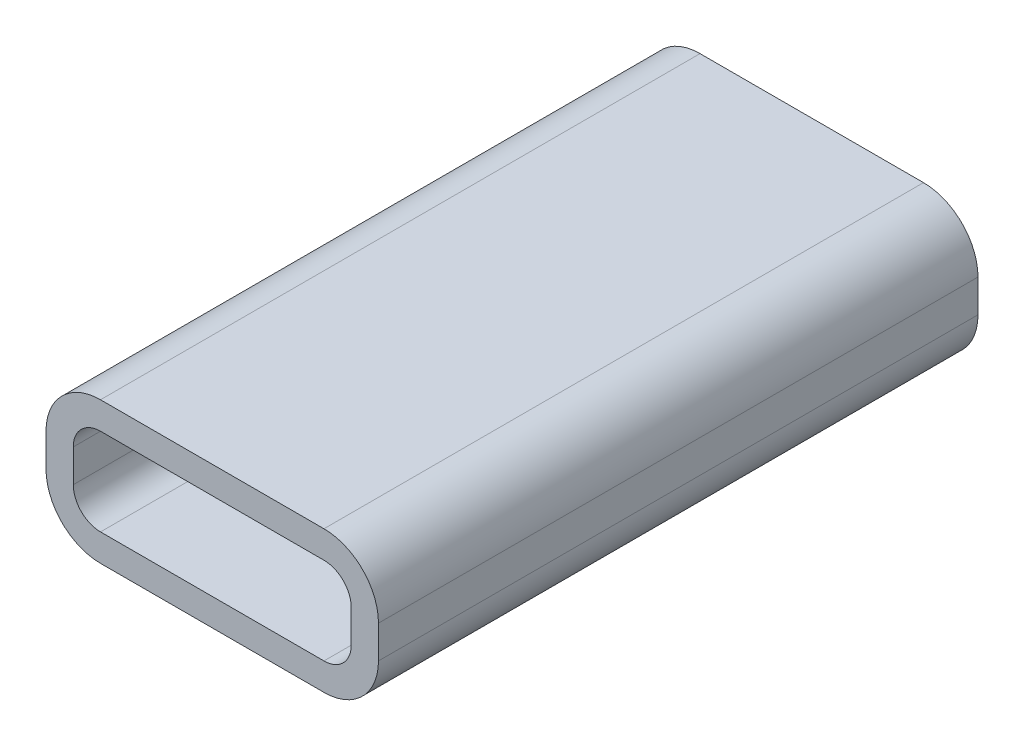
ISO-10303-21;
HEADER;
FILE_DESCRIPTION(('STEP AP214'),'2;1');
FILE_NAME('part.step','',(''),(''),'','','');
FILE_SCHEMA(('AUTOMOTIVE_DESIGN { 1 0 10303 214 1 1 1 1 }'));
ENDSEC;
DATA;
#1=APPLICATION_CONTEXT('core data for automotive mechanical design processes');
#2=APPLICATION_PROTOCOL_DEFINITION('international standard','automotive_design',2000,#1);
#3=PRODUCT_CONTEXT('',#1,'mechanical');
#4=PRODUCT('Part','Part','',(#3));
#5=PRODUCT_RELATED_PRODUCT_CATEGORY('part','',(#4));
#6=PRODUCT_DEFINITION_FORMATION('','',#4);
#7=PRODUCT_DEFINITION_CONTEXT('part definition',#1,'design');
#8=PRODUCT_DEFINITION('design','',#6,#7);
#9=PRODUCT_DEFINITION_SHAPE('','',#8);
#10=(LENGTH_UNIT() NAMED_UNIT(*) SI_UNIT(.MILLI.,.METRE.));
#11=(NAMED_UNIT(*) PLANE_ANGLE_UNIT() SI_UNIT($,.RADIAN.));
#12=(NAMED_UNIT(*) SI_UNIT($,.STERADIAN.) SOLID_ANGLE_UNIT());
#13=UNCERTAINTY_MEASURE_WITH_UNIT(LENGTH_MEASURE(1.E-05),#10,'distance_accuracy_value','');
#14=(GEOMETRIC_REPRESENTATION_CONTEXT(3) GLOBAL_UNCERTAINTY_ASSIGNED_CONTEXT((#13)) GLOBAL_UNIT_ASSIGNED_CONTEXT((#10,
#11,#12)) REPRESENTATION_CONTEXT('',''));
#15=CARTESIAN_POINT('',(0.,0.,0.));
#16=DIRECTION('',(0.,0.,1.));
#17=DIRECTION('',(1.,0.,0.));
#18=AXIS2_PLACEMENT_3D('',#15,#16,#17);
#19=CARTESIAN_POINT('',(-4.1,0.600000000000001,10.));
#20=DIRECTION('',(0.,0.,1.));
#21=DIRECTION('',(1.,0.,0.));
#22=AXIS2_PLACEMENT_3D('',#19,#20,#21);
#23=PLANE('',#22);
#24=CARTESIAN_POINT('',(-4.1,0.600000000000001,10.));
#25=DIRECTION('',(0.,0.,1.));
#26=DIRECTION('',(1.,0.,0.));
#27=AXIS2_PLACEMENT_3D('',#24,#25,#26);
#28=CIRCLE('',#27,2.);
#29=CARTESIAN_POINT('',(-4.1,2.6,10.));
#30=VERTEX_POINT('',#29);
#31=CARTESIAN_POINT('',(-6.1,0.600000000000001,10.));
#32=VERTEX_POINT('',#31);
#33=EDGE_CURVE('E333',#30,#32,#28,.T.);
#34=ORIENTED_EDGE('',*,*,#33,.T.);
#35=DIRECTION('',(0.,-1.,0.));
#36=VECTOR('',#35,1.);
#37=CARTESIAN_POINT('',(-6.1,-0.600000000000001,10.));
#38=LINE('',#37,#36);
#39=CARTESIAN_POINT('',(-6.1,-0.600000000000001,10.));
#40=VERTEX_POINT('',#39);
#41=EDGE_CURVE('E335',#32,#40,#38,.T.);
#42=ORIENTED_EDGE('',*,*,#41,.T.);
#43=CARTESIAN_POINT('',(-4.1,-0.600000000000001,10.));
#44=DIRECTION('',(0.,0.,1.));
#45=DIRECTION('',(-1.,0.,0.));
#46=AXIS2_PLACEMENT_3D('',#43,#44,#45);
#47=CIRCLE('',#46,2.);
#48=CARTESIAN_POINT('',(-4.1,-2.6,10.));
#49=VERTEX_POINT('',#48);
#50=EDGE_CURVE('E337',#40,#49,#47,.T.);
#51=ORIENTED_EDGE('',*,*,#50,.T.);
#52=DIRECTION('',(1.,0.,0.));
#53=VECTOR('',#52,1.);
#54=CARTESIAN_POINT('',(4.1,-2.6,10.));
#55=LINE('',#54,#53);
#56=CARTESIAN_POINT('',(4.1,-2.6,10.));
#57=VERTEX_POINT('',#56);
#58=EDGE_CURVE('E339',#49,#57,#55,.T.);
#59=ORIENTED_EDGE('',*,*,#58,.T.);
#60=CARTESIAN_POINT('',(4.1,-0.600000000000001,10.));
#61=DIRECTION('',(0.,0.,1.));
#62=DIRECTION('',(-1.,0.,0.));
#63=AXIS2_PLACEMENT_3D('',#60,#61,#62);
#64=CIRCLE('',#63,2.);
#65=CARTESIAN_POINT('',(6.1,-0.600000000000001,10.));
#66=VERTEX_POINT('',#65);
#67=EDGE_CURVE('E341',#57,#66,#64,.T.);
#68=ORIENTED_EDGE('',*,*,#67,.T.);
#69=DIRECTION('',(0.,1.,0.));
#70=VECTOR('',#69,1.);
#71=CARTESIAN_POINT('',(6.1,0.600000000000001,10.));
#72=LINE('',#71,#70);
#73=CARTESIAN_POINT('',(6.1,0.600000000000001,10.));
#74=VERTEX_POINT('',#73);
#75=EDGE_CURVE('E343',#66,#74,#72,.T.);
#76=ORIENTED_EDGE('',*,*,#75,.T.);
#77=CARTESIAN_POINT('',(4.1,0.600000000000001,10.));
#78=DIRECTION('',(0.,0.,1.));
#79=DIRECTION('',(-1.,0.,0.));
#80=AXIS2_PLACEMENT_3D('',#77,#78,#79);
#81=CIRCLE('',#80,2.);
#82=CARTESIAN_POINT('',(4.1,2.6,10.));
#83=VERTEX_POINT('',#82);
#84=EDGE_CURVE('E345',#74,#83,#81,.T.);
#85=ORIENTED_EDGE('',*,*,#84,.T.);
#86=DIRECTION('',(-1.,0.,0.));
#87=VECTOR('',#86,1.);
#88=CARTESIAN_POINT('',(-4.1,2.6,10.));
#89=LINE('',#88,#87);
#90=EDGE_CURVE('E55',#83,#30,#89,.T.);
#91=ORIENTED_EDGE('',*,*,#90,.T.);
#92=EDGE_LOOP('',(#34,#42,#51,#59,#68,#76,#85,#91));
#93=FACE_BOUND('',#92,.T.);
#94=DIRECTION('',(1.,0.,0.));
#95=VECTOR('',#94,1.);
#96=CARTESIAN_POINT('',(4.1,-1.6,10.));
#97=LINE('',#96,#95);
#98=CARTESIAN_POINT('',(-4.1,-1.6,10.));
#99=VERTEX_POINT('',#98);
#100=CARTESIAN_POINT('',(4.1,-1.6,10.));
#101=VERTEX_POINT('',#100);
#102=EDGE_CURVE('E280',#99,#101,#97,.T.);
#103=ORIENTED_EDGE('',*,*,#102,.F.);
#104=CARTESIAN_POINT('',(-4.1,-0.600000000000001,10.));
#105=DIRECTION('',(0.,0.,1.));
#106=DIRECTION('',(-1.,0.,0.));
#107=AXIS2_PLACEMENT_3D('',#104,#105,#106);
#108=CIRCLE('',#107,1.);
#109=CARTESIAN_POINT('',(-5.1,-0.600000000000001,10.));
#110=VERTEX_POINT('',#109);
#111=EDGE_CURVE('E278',#110,#99,#108,.T.);
#112=ORIENTED_EDGE('',*,*,#111,.F.);
#113=DIRECTION('',(0.,-1.,0.));
#114=VECTOR('',#113,1.);
#115=CARTESIAN_POINT('',(-5.1,-0.600000000000001,10.));
#116=LINE('',#115,#114);
#117=CARTESIAN_POINT('',(-5.1,0.600000000000001,10.));
#118=VERTEX_POINT('',#117);
#119=EDGE_CURVE('E293',#118,#110,#116,.T.);
#120=ORIENTED_EDGE('',*,*,#119,.F.);
#121=CARTESIAN_POINT('',(-4.1,0.600000000000001,10.));
#122=DIRECTION('',(0.,0.,1.));
#123=DIRECTION('',(1.,0.,0.));
#124=AXIS2_PLACEMENT_3D('',#121,#122,#123);
#125=CIRCLE('',#124,1.);
#126=CARTESIAN_POINT('',(-4.1,1.6,10.));
#127=VERTEX_POINT('',#126);
#128=EDGE_CURVE('E291',#127,#118,#125,.T.);
#129=ORIENTED_EDGE('',*,*,#128,.F.);
#130=DIRECTION('',(-1.,0.,0.));
#131=VECTOR('',#130,1.);
#132=CARTESIAN_POINT('',(-4.1,1.6,10.));
#133=LINE('',#132,#131);
#134=CARTESIAN_POINT('',(4.1,1.6,10.));
#135=VERTEX_POINT('',#134);
#136=EDGE_CURVE('E289',#135,#127,#133,.T.);
#137=ORIENTED_EDGE('',*,*,#136,.F.);
#138=CARTESIAN_POINT('',(4.1,0.600000000000001,10.));
#139=DIRECTION('',(0.,0.,1.));
#140=DIRECTION('',(-1.,0.,0.));
#141=AXIS2_PLACEMENT_3D('',#138,#139,#140);
#142=CIRCLE('',#141,1.);
#143=CARTESIAN_POINT('',(5.1,0.600000000000001,10.));
#144=VERTEX_POINT('',#143);
#145=EDGE_CURVE('E287',#144,#135,#142,.T.);
#146=ORIENTED_EDGE('',*,*,#145,.F.);
#147=DIRECTION('',(0.,1.,0.));
#148=VECTOR('',#147,1.);
#149=CARTESIAN_POINT('',(5.1,0.600000000000001,10.));
#150=LINE('',#149,#148);
#151=CARTESIAN_POINT('',(5.1,-0.600000000000001,10.));
#152=VERTEX_POINT('',#151);
#153=EDGE_CURVE('E285',#152,#144,#150,.T.);
#154=ORIENTED_EDGE('',*,*,#153,.F.);
#155=CARTESIAN_POINT('',(4.1,-0.600000000000001,10.));
#156=DIRECTION('',(0.,0.,1.));
#157=DIRECTION('',(-1.,0.,0.));
#158=AXIS2_PLACEMENT_3D('',#155,#156,#157);
#159=CIRCLE('',#158,1.);
#160=EDGE_CURVE('E283',#101,#152,#159,.T.);
#161=ORIENTED_EDGE('',*,*,#160,.F.);
#162=EDGE_LOOP('',(#103,#112,#120,#129,#137,#146,#154,#161));
#163=FACE_BOUND('',#162,.T.);
#164=ADVANCED_FACE('F32',(#93,#163),#23,.T.);
#165=CARTESIAN_POINT('',(-4.1,0.600000000000001,10.));
#166=DIRECTION('',(0.,0.,-1.));
#167=DIRECTION('',(-1.,0.,0.));
#168=AXIS2_PLACEMENT_3D('',#165,#166,#167);
#169=CYLINDRICAL_SURFACE('',#168,2.);
#170=DIRECTION('',(0.,0.,-1.));
#171=VECTOR('',#170,1.);
#172=CARTESIAN_POINT('',(-4.1,2.6,10.));
#173=LINE('',#172,#171);
#174=CARTESIAN_POINT('',(-4.1,2.6,-12.));
#175=VERTEX_POINT('',#174);
#176=EDGE_CURVE('E348',#30,#175,#173,.T.);
#177=ORIENTED_EDGE('',*,*,#176,.T.);
#178=CARTESIAN_POINT('',(-4.1,0.600000000000001,-12.));
#179=DIRECTION('',(0.,0.,1.));
#180=DIRECTION('',(1.,0.,0.));
#181=AXIS2_PLACEMENT_3D('',#178,#179,#180);
#182=CIRCLE('',#181,2.);
#183=CARTESIAN_POINT('',(-6.1,0.600000000000001,-12.));
#184=VERTEX_POINT('',#183);
#185=EDGE_CURVE('E253',#175,#184,#182,.T.);
#186=ORIENTED_EDGE('',*,*,#185,.T.);
#187=DIRECTION('',(0.,0.,-1.));
#188=VECTOR('',#187,1.);
#189=CARTESIAN_POINT('',(-6.1,0.600000000000001,10.));
#190=LINE('',#189,#188);
#191=EDGE_CURVE('E11',#32,#184,#190,.T.);
#192=ORIENTED_EDGE('',*,*,#191,.F.);
#193=ORIENTED_EDGE('',*,*,#33,.F.);
#194=EDGE_LOOP('',(#177,#186,#192,#193));
#195=FACE_BOUND('',#194,.T.);
#196=ADVANCED_FACE('F34',(#195),#169,.T.);
#197=CARTESIAN_POINT('',(-6.1,-0.600000000000001,10.));
#198=DIRECTION('',(1.,0.,0.));
#199=DIRECTION('',(0.,1.,0.));
#200=AXIS2_PLACEMENT_3D('',#197,#198,#199);
#201=PLANE('',#200);
#202=ORIENTED_EDGE('',*,*,#191,.T.);
#203=DIRECTION('',(0.,-1.,0.));
#204=VECTOR('',#203,1.);
#205=CARTESIAN_POINT('',(-6.1,-0.600000000000001,-12.));
#206=LINE('',#205,#204);
#207=CARTESIAN_POINT('',(-6.1,-0.600000000000001,-12.));
#208=VERTEX_POINT('',#207);
#209=EDGE_CURVE('E256',#184,#208,#206,.T.);
#210=ORIENTED_EDGE('',*,*,#209,.T.);
#211=DIRECTION('',(0.,0.,-1.));
#212=VECTOR('',#211,1.);
#213=CARTESIAN_POINT('',(-6.1,-0.600000000000001,10.));
#214=LINE('',#213,#212);
#215=EDGE_CURVE('E40',#40,#208,#214,.T.);
#216=ORIENTED_EDGE('',*,*,#215,.F.);
#217=ORIENTED_EDGE('',*,*,#41,.F.);
#218=EDGE_LOOP('',(#202,#210,#216,#217));
#219=FACE_BOUND('',#218,.T.);
#220=ADVANCED_FACE('F368',(#219),#201,.F.);
#221=CARTESIAN_POINT('',(-4.1,-0.600000000000001,10.));
#222=DIRECTION('',(0.,0.,-1.));
#223=DIRECTION('',(-1.,0.,0.));
#224=AXIS2_PLACEMENT_3D('',#221,#222,#223);
#225=CYLINDRICAL_SURFACE('',#224,2.);
#226=ORIENTED_EDGE('',*,*,#215,.T.);
#227=CARTESIAN_POINT('',(-4.1,-0.600000000000001,-12.));
#228=DIRECTION('',(0.,0.,1.));
#229=DIRECTION('',(-1.,0.,0.));
#230=AXIS2_PLACEMENT_3D('',#227,#228,#229);
#231=CIRCLE('',#230,2.);
#232=CARTESIAN_POINT('',(-4.1,-2.6,-12.));
#233=VERTEX_POINT('',#232);
#234=EDGE_CURVE('E259',#208,#233,#231,.T.);
#235=ORIENTED_EDGE('',*,*,#234,.T.);
#236=DIRECTION('',(0.,0.,-1.));
#237=VECTOR('',#236,1.);
#238=CARTESIAN_POINT('',(-4.1,-2.6,10.));
#239=LINE('',#238,#237);
#240=EDGE_CURVE('E358',#49,#233,#239,.T.);
#241=ORIENTED_EDGE('',*,*,#240,.F.);
#242=ORIENTED_EDGE('',*,*,#50,.F.);
#243=EDGE_LOOP('',(#226,#235,#241,#242));
#244=FACE_BOUND('',#243,.T.);
#245=ADVANCED_FACE('F362',(#244),#225,.T.);
#246=CARTESIAN_POINT('',(4.1,-2.6,10.));
#247=DIRECTION('',(0.,1.,0.));
#248=DIRECTION('',(0.,0.,1.));
#249=AXIS2_PLACEMENT_3D('',#246,#247,#248);
#250=PLANE('',#249);
#251=ORIENTED_EDGE('',*,*,#240,.T.);
#252=DIRECTION('',(1.,0.,0.));
#253=VECTOR('',#252,1.);
#254=CARTESIAN_POINT('',(4.1,-2.6,-12.));
#255=LINE('',#254,#253);
#256=CARTESIAN_POINT('',(4.1,-2.6,-12.));
#257=VERTEX_POINT('',#256);
#258=EDGE_CURVE('E262',#233,#257,#255,.T.);
#259=ORIENTED_EDGE('',*,*,#258,.T.);
#260=DIRECTION('',(0.,0.,-1.));
#261=VECTOR('',#260,1.);
#262=CARTESIAN_POINT('',(4.1,-2.6,10.));
#263=LINE('',#262,#261);
#264=EDGE_CURVE('E356',#57,#257,#263,.T.);
#265=ORIENTED_EDGE('',*,*,#264,.F.);
#266=ORIENTED_EDGE('',*,*,#58,.F.);
#267=EDGE_LOOP('',(#251,#259,#265,#266));
#268=FACE_BOUND('',#267,.T.);
#269=ADVANCED_FACE('F378',(#268),#250,.F.);
#270=CARTESIAN_POINT('',(4.1,-0.600000000000001,10.));
#271=DIRECTION('',(0.,0.,-1.));
#272=DIRECTION('',(-1.,0.,0.));
#273=AXIS2_PLACEMENT_3D('',#270,#271,#272);
#274=CYLINDRICAL_SURFACE('',#273,2.);
#275=ORIENTED_EDGE('',*,*,#264,.T.);
#276=CARTESIAN_POINT('',(4.1,-0.600000000000001,-12.));
#277=DIRECTION('',(0.,0.,1.));
#278=DIRECTION('',(-1.,0.,0.));
#279=AXIS2_PLACEMENT_3D('',#276,#277,#278);
#280=CIRCLE('',#279,2.);
#281=CARTESIAN_POINT('',(6.1,-0.600000000000001,-12.));
#282=VERTEX_POINT('',#281);
#283=EDGE_CURVE('E265',#257,#282,#280,.T.);
#284=ORIENTED_EDGE('',*,*,#283,.T.);
#285=DIRECTION('',(0.,0.,-1.));
#286=VECTOR('',#285,1.);
#287=CARTESIAN_POINT('',(6.1,-0.600000000000001,10.));
#288=LINE('',#287,#286);
#289=EDGE_CURVE('E354',#66,#282,#288,.T.);
#290=ORIENTED_EDGE('',*,*,#289,.F.);
#291=ORIENTED_EDGE('',*,*,#67,.F.);
#292=EDGE_LOOP('',(#275,#284,#290,#291));
#293=FACE_BOUND('',#292,.T.);
#294=ADVANCED_FACE('F398',(#293),#274,.T.);
#295=CARTESIAN_POINT('',(6.1,0.600000000000001,10.));
#296=DIRECTION('',(-1.,0.,0.));
#297=DIRECTION('',(0.,-1.,0.));
#298=AXIS2_PLACEMENT_3D('',#295,#296,#297);
#299=PLANE('',#298);
#300=ORIENTED_EDGE('',*,*,#289,.T.);
#301=DIRECTION('',(0.,1.,0.));
#302=VECTOR('',#301,1.);
#303=CARTESIAN_POINT('',(6.1,0.600000000000001,-12.));
#304=LINE('',#303,#302);
#305=CARTESIAN_POINT('',(6.1,0.600000000000001,-12.));
#306=VERTEX_POINT('',#305);
#307=EDGE_CURVE('E268',#282,#306,#304,.T.);
#308=ORIENTED_EDGE('',*,*,#307,.T.);
#309=DIRECTION('',(0.,0.,-1.));
#310=VECTOR('',#309,1.);
#311=CARTESIAN_POINT('',(6.1,0.600000000000001,10.));
#312=LINE('',#311,#310);
#313=EDGE_CURVE('E352',#74,#306,#312,.T.);
#314=ORIENTED_EDGE('',*,*,#313,.F.);
#315=ORIENTED_EDGE('',*,*,#75,.F.);
#316=EDGE_LOOP('',(#300,#308,#314,#315));
#317=FACE_BOUND('',#316,.T.);
#318=ADVANCED_FACE('F396',(#317),#299,.F.);
#319=CARTESIAN_POINT('',(4.1,0.600000000000001,10.));
#320=DIRECTION('',(0.,0.,-1.));
#321=DIRECTION('',(-1.,0.,0.));
#322=AXIS2_PLACEMENT_3D('',#319,#320,#321);
#323=CYLINDRICAL_SURFACE('',#322,2.);
#324=ORIENTED_EDGE('',*,*,#313,.T.);
#325=CARTESIAN_POINT('',(4.1,0.600000000000001,-12.));
#326=DIRECTION('',(0.,0.,1.));
#327=DIRECTION('',(-1.,0.,0.));
#328=AXIS2_PLACEMENT_3D('',#325,#326,#327);
#329=CIRCLE('',#328,2.);
#330=CARTESIAN_POINT('',(4.1,2.6,-12.));
#331=VERTEX_POINT('',#330);
#332=EDGE_CURVE('E271',#306,#331,#329,.T.);
#333=ORIENTED_EDGE('',*,*,#332,.T.);
#334=DIRECTION('',(0.,0.,-1.));
#335=VECTOR('',#334,1.);
#336=CARTESIAN_POINT('',(4.1,2.6,10.));
#337=LINE('',#336,#335);
#338=EDGE_CURVE('E350',#83,#331,#337,.T.);
#339=ORIENTED_EDGE('',*,*,#338,.F.);
#340=ORIENTED_EDGE('',*,*,#84,.F.);
#341=EDGE_LOOP('',(#324,#333,#339,#340));
#342=FACE_BOUND('',#341,.T.);
#343=ADVANCED_FACE('F392',(#342),#323,.T.);
#344=CARTESIAN_POINT('',(-4.1,2.6,10.));
#345=DIRECTION('',(0.,-1.,0.));
#346=DIRECTION('',(0.,0.,-1.));
#347=AXIS2_PLACEMENT_3D('',#344,#345,#346);
#348=PLANE('',#347);
#349=ORIENTED_EDGE('',*,*,#338,.T.);
#350=DIRECTION('',(-1.,0.,0.));
#351=VECTOR('',#350,1.);
#352=CARTESIAN_POINT('',(-4.1,2.6,-12.));
#353=LINE('',#352,#351);
#354=EDGE_CURVE('E274',#331,#175,#353,.T.);
#355=ORIENTED_EDGE('',*,*,#354,.T.);
#356=ORIENTED_EDGE('',*,*,#176,.F.);
#357=ORIENTED_EDGE('',*,*,#90,.F.);
#358=EDGE_LOOP('',(#349,#355,#356,#357));
#359=FACE_BOUND('',#358,.T.);
#360=ADVANCED_FACE('F388',(#359),#348,.F.);
#361=CARTESIAN_POINT('',(-4.1,-0.600000000000001,10.));
#362=DIRECTION('',(0.,0.,-1.));
#363=DIRECTION('',(-1.,0.,0.));
#364=AXIS2_PLACEMENT_3D('',#361,#362,#363);
#365=CYLINDRICAL_SURFACE('',#364,1.);
#366=CARTESIAN_POINT('',(-4.1,-0.600000000000001,0.));
#367=DIRECTION('',(0.,0.,1.));
#368=DIRECTION('',(-1.,0.,0.));
#369=AXIS2_PLACEMENT_3D('',#366,#367,#368);
#370=CIRCLE('',#369,1.);
#371=CARTESIAN_POINT('',(-5.1,-0.600000000000001,0.));
#372=VERTEX_POINT('',#371);
#373=CARTESIAN_POINT('',(-4.1,-1.6,0.));
#374=VERTEX_POINT('',#373);
#375=EDGE_CURVE('E277',#372,#374,#370,.T.);
#376=ORIENTED_EDGE('',*,*,#375,.F.);
#377=DIRECTION('',(0.,0.,-1.));
#378=VECTOR('',#377,1.);
#379=CARTESIAN_POINT('',(-5.1,-0.600000000000001,10.));
#380=LINE('',#379,#378);
#381=EDGE_CURVE('E295',#110,#372,#380,.T.);
#382=ORIENTED_EDGE('',*,*,#381,.F.);
#383=ORIENTED_EDGE('',*,*,#111,.T.);
#384=DIRECTION('',(0.,0.,-1.));
#385=VECTOR('',#384,1.);
#386=CARTESIAN_POINT('',(-4.1,-1.6,10.));
#387=LINE('',#386,#385);
#388=EDGE_CURVE('E330',#99,#374,#387,.T.);
#389=ORIENTED_EDGE('',*,*,#388,.T.);
#390=EDGE_LOOP('',(#376,#382,#383,#389));
#391=FACE_BOUND('',#390,.T.);
#392=ADVANCED_FACE('F414',(#391),#365,.F.);
#393=CARTESIAN_POINT('',(4.1,-1.6,10.));
#394=DIRECTION('',(0.,1.,0.));
#395=DIRECTION('',(0.,0.,1.));
#396=AXIS2_PLACEMENT_3D('',#393,#394,#395);
#397=PLANE('',#396);
#398=DIRECTION('',(1.,0.,0.));
#399=VECTOR('',#398,1.);
#400=CARTESIAN_POINT('',(4.1,-1.6,0.));
#401=LINE('',#400,#399);
#402=CARTESIAN_POINT('',(4.1,-1.6,0.));
#403=VERTEX_POINT('',#402);
#404=EDGE_CURVE('E298',#374,#403,#401,.T.);
#405=ORIENTED_EDGE('',*,*,#404,.F.);
#406=ORIENTED_EDGE('',*,*,#388,.F.);
#407=ORIENTED_EDGE('',*,*,#102,.T.);
#408=DIRECTION('',(0.,0.,-1.));
#409=VECTOR('',#408,1.);
#410=CARTESIAN_POINT('',(4.1,-1.6,10.));
#411=LINE('',#410,#409);
#412=EDGE_CURVE('E328',#101,#403,#411,.T.);
#413=ORIENTED_EDGE('',*,*,#412,.T.);
#414=EDGE_LOOP('',(#405,#406,#407,#413));
#415=FACE_BOUND('',#414,.T.);
#416=ADVANCED_FACE('F434',(#415),#397,.T.);
#417=CARTESIAN_POINT('',(4.1,-0.600000000000001,10.));
#418=DIRECTION('',(0.,0.,-1.));
#419=DIRECTION('',(-1.,0.,0.));
#420=AXIS2_PLACEMENT_3D('',#417,#418,#419);
#421=CYLINDRICAL_SURFACE('',#420,1.);
#422=CARTESIAN_POINT('',(4.1,-0.600000000000001,0.));
#423=DIRECTION('',(0.,0.,1.));
#424=DIRECTION('',(-1.,0.,0.));
#425=AXIS2_PLACEMENT_3D('',#422,#423,#424);
#426=CIRCLE('',#425,1.);
#427=CARTESIAN_POINT('',(5.1,-0.600000000000001,0.));
#428=VERTEX_POINT('',#427);
#429=EDGE_CURVE('E301',#403,#428,#426,.T.);
#430=ORIENTED_EDGE('',*,*,#429,.F.);
#431=ORIENTED_EDGE('',*,*,#412,.F.);
#432=ORIENTED_EDGE('',*,*,#160,.T.);
#433=DIRECTION('',(0.,0.,-1.));
#434=VECTOR('',#433,1.);
#435=CARTESIAN_POINT('',(5.1,-0.600000000000001,10.));
#436=LINE('',#435,#434);
#437=EDGE_CURVE('E326',#152,#428,#436,.T.);
#438=ORIENTED_EDGE('',*,*,#437,.T.);
#439=EDGE_LOOP('',(#430,#431,#432,#438));
#440=FACE_BOUND('',#439,.T.);
#441=ADVANCED_FACE('F441',(#440),#421,.F.);
#442=CARTESIAN_POINT('',(5.1,0.600000000000001,10.));
#443=DIRECTION('',(-1.,0.,0.));
#444=DIRECTION('',(0.,0.,1.));
#445=AXIS2_PLACEMENT_3D('',#442,#443,#444);
#446=PLANE('',#445);
#447=DIRECTION('',(0.,1.,0.));
#448=VECTOR('',#447,1.);
#449=CARTESIAN_POINT('',(5.1,0.600000000000001,0.));
#450=LINE('',#449,#448);
#451=CARTESIAN_POINT('',(5.1,0.600000000000001,0.));
#452=VERTEX_POINT('',#451);
#453=EDGE_CURVE('E304',#428,#452,#450,.T.);
#454=ORIENTED_EDGE('',*,*,#453,.F.);
#455=ORIENTED_EDGE('',*,*,#437,.F.);
#456=ORIENTED_EDGE('',*,*,#153,.T.);
#457=DIRECTION('',(0.,0.,-1.));
#458=VECTOR('',#457,1.);
#459=CARTESIAN_POINT('',(5.1,0.600000000000001,10.));
#460=LINE('',#459,#458);
#461=EDGE_CURVE('E324',#144,#452,#460,.T.);
#462=ORIENTED_EDGE('',*,*,#461,.T.);
#463=EDGE_LOOP('',(#454,#455,#456,#462));
#464=FACE_BOUND('',#463,.T.);
#465=ADVANCED_FACE('F448',(#464),#446,.T.);
#466=CARTESIAN_POINT('',(4.1,0.600000000000001,10.));
#467=DIRECTION('',(0.,0.,-1.));
#468=DIRECTION('',(-1.,0.,0.));
#469=AXIS2_PLACEMENT_3D('',#466,#467,#468);
#470=CYLINDRICAL_SURFACE('',#469,1.);
#471=CARTESIAN_POINT('',(4.1,0.600000000000001,0.));
#472=DIRECTION('',(0.,0.,1.));
#473=DIRECTION('',(-1.,0.,0.));
#474=AXIS2_PLACEMENT_3D('',#471,#472,#473);
#475=CIRCLE('',#474,1.);
#476=CARTESIAN_POINT('',(4.1,1.6,0.));
#477=VERTEX_POINT('',#476);
#478=EDGE_CURVE('E307',#452,#477,#475,.T.);
#479=ORIENTED_EDGE('',*,*,#478,.F.);
#480=ORIENTED_EDGE('',*,*,#461,.F.);
#481=ORIENTED_EDGE('',*,*,#145,.T.);
#482=DIRECTION('',(0.,0.,-1.));
#483=VECTOR('',#482,1.);
#484=CARTESIAN_POINT('',(4.1,1.6,10.));
#485=LINE('',#484,#483);
#486=EDGE_CURVE('E322',#135,#477,#485,.T.);
#487=ORIENTED_EDGE('',*,*,#486,.T.);
#488=EDGE_LOOP('',(#479,#480,#481,#487));
#489=FACE_BOUND('',#488,.T.);
#490=ADVANCED_FACE('F456',(#489),#470,.F.);
#491=CARTESIAN_POINT('',(-4.1,1.6,10.));
#492=DIRECTION('',(0.,-1.,0.));
#493=DIRECTION('',(0.,0.,-1.));
#494=AXIS2_PLACEMENT_3D('',#491,#492,#493);
#495=PLANE('',#494);
#496=DIRECTION('',(-1.,0.,0.));
#497=VECTOR('',#496,1.);
#498=CARTESIAN_POINT('',(-4.1,1.6,0.));
#499=LINE('',#498,#497);
#500=CARTESIAN_POINT('',(-4.1,1.6,0.));
#501=VERTEX_POINT('',#500);
#502=EDGE_CURVE('E310',#477,#501,#499,.T.);
#503=ORIENTED_EDGE('',*,*,#502,.F.);
#504=ORIENTED_EDGE('',*,*,#486,.F.);
#505=ORIENTED_EDGE('',*,*,#136,.T.);
#506=DIRECTION('',(0.,0.,-1.));
#507=VECTOR('',#506,1.);
#508=CARTESIAN_POINT('',(-4.1,1.6,10.));
#509=LINE('',#508,#507);
#510=EDGE_CURVE('E320',#127,#501,#509,.T.);
#511=ORIENTED_EDGE('',*,*,#510,.T.);
#512=EDGE_LOOP('',(#503,#504,#505,#511));
#513=FACE_BOUND('',#512,.T.);
#514=ADVANCED_FACE('F464',(#513),#495,.T.);
#515=CARTESIAN_POINT('',(-4.1,0.600000000000001,10.));
#516=DIRECTION('',(0.,0.,-1.));
#517=DIRECTION('',(-1.,0.,0.));
#518=AXIS2_PLACEMENT_3D('',#515,#516,#517);
#519=CYLINDRICAL_SURFACE('',#518,1.);
#520=CARTESIAN_POINT('',(-4.1,0.600000000000001,0.));
#521=DIRECTION('',(0.,0.,1.));
#522=DIRECTION('',(1.,0.,0.));
#523=AXIS2_PLACEMENT_3D('',#520,#521,#522);
#524=CIRCLE('',#523,1.);
#525=CARTESIAN_POINT('',(-5.1,0.600000000000001,0.));
#526=VERTEX_POINT('',#525);
#527=EDGE_CURVE('E313',#501,#526,#524,.T.);
#528=ORIENTED_EDGE('',*,*,#527,.F.);
#529=ORIENTED_EDGE('',*,*,#510,.F.);
#530=ORIENTED_EDGE('',*,*,#128,.T.);
#531=DIRECTION('',(0.,0.,-1.));
#532=VECTOR('',#531,1.);
#533=CARTESIAN_POINT('',(-5.1,0.600000000000001,10.));
#534=LINE('',#533,#532);
#535=EDGE_CURVE('E47',#118,#526,#534,.T.);
#536=ORIENTED_EDGE('',*,*,#535,.T.);
#537=EDGE_LOOP('',(#528,#529,#530,#536));
#538=FACE_BOUND('',#537,.T.);
#539=ADVANCED_FACE('F472',(#538),#519,.F.);
#540=CARTESIAN_POINT('',(-5.1,-0.600000000000001,10.));
#541=DIRECTION('',(1.,0.,0.));
#542=DIRECTION('',(0.,0.,-1.));
#543=AXIS2_PLACEMENT_3D('',#540,#541,#542);
#544=PLANE('',#543);
#545=DIRECTION('',(0.,-1.,0.));
#546=VECTOR('',#545,1.);
#547=CARTESIAN_POINT('',(-5.1,-0.600000000000001,0.));
#548=LINE('',#547,#546);
#549=EDGE_CURVE('E281',#526,#372,#548,.T.);
#550=ORIENTED_EDGE('',*,*,#549,.F.);
#551=ORIENTED_EDGE('',*,*,#535,.F.);
#552=ORIENTED_EDGE('',*,*,#119,.T.);
#553=ORIENTED_EDGE('',*,*,#381,.T.);
#554=EDGE_LOOP('',(#550,#551,#552,#553));
#555=FACE_BOUND('',#554,.T.);
#556=ADVANCED_FACE('F480',(#555),#544,.T.);
#557=CARTESIAN_POINT('',(-4.1,0.600000000000001,0.));
#558=DIRECTION('',(0.,0.,-1.));
#559=DIRECTION('',(-1.,0.,0.));
#560=AXIS2_PLACEMENT_3D('',#557,#558,#559);
#561=PLANE('',#560);
#562=ORIENTED_EDGE('',*,*,#549,.T.);
#563=ORIENTED_EDGE('',*,*,#375,.T.);
#564=ORIENTED_EDGE('',*,*,#404,.T.);
#565=ORIENTED_EDGE('',*,*,#429,.T.);
#566=ORIENTED_EDGE('',*,*,#453,.T.);
#567=ORIENTED_EDGE('',*,*,#478,.T.);
#568=ORIENTED_EDGE('',*,*,#502,.T.);
#569=ORIENTED_EDGE('',*,*,#527,.T.);
#570=EDGE_LOOP('',(#562,#563,#564,#565,#566,#567,#568,#569));
#571=FACE_BOUND('',#570,.T.);
#572=ADVANCED_FACE('F488',(#571),#561,.F.);
#573=CARTESIAN_POINT('',(-4.1,0.600000000000001,-12.));
#574=DIRECTION('',(0.,0.,-1.));
#575=DIRECTION('',(1.,0.,0.));
#576=AXIS2_PLACEMENT_3D('',#573,#574,#575);
#577=PLANE('',#576);
#578=ORIENTED_EDGE('',*,*,#185,.F.);
#579=ORIENTED_EDGE('',*,*,#354,.F.);
#580=ORIENTED_EDGE('',*,*,#332,.F.);
#581=ORIENTED_EDGE('',*,*,#307,.F.);
#582=ORIENTED_EDGE('',*,*,#283,.F.);
#583=ORIENTED_EDGE('',*,*,#258,.F.);
#584=ORIENTED_EDGE('',*,*,#234,.F.);
#585=ORIENTED_EDGE('',*,*,#209,.F.);
#586=EDGE_LOOP('',(#578,#579,#580,#581,#582,#583,#584,#585));
#587=FACE_BOUND('',#586,.T.);
#588=DIRECTION('',(1.,0.,0.));
#589=VECTOR('',#588,1.);
#590=CARTESIAN_POINT('',(4.1,-1.6,-12.));
#591=LINE('',#590,#589);
#592=CARTESIAN_POINT('',(-4.1,-1.6,-12.));
#593=VERTEX_POINT('',#592);
#594=CARTESIAN_POINT('',(4.1,-1.6,-12.));
#595=VERTEX_POINT('',#594);
#596=EDGE_CURVE('E688',#593,#595,#591,.T.);
#597=ORIENTED_EDGE('',*,*,#596,.T.);
#598=CARTESIAN_POINT('',(4.1,-0.600000000000001,-12.));
#599=DIRECTION('',(0.,0.,1.));
#600=DIRECTION('',(-1.,0.,0.));
#601=AXIS2_PLACEMENT_3D('',#598,#599,#600);
#602=CIRCLE('',#601,1.);
#603=CARTESIAN_POINT('',(5.1,-0.600000000000001,-12.));
#604=VERTEX_POINT('',#603);
#605=EDGE_CURVE('E685',#595,#604,#602,.T.);
#606=ORIENTED_EDGE('',*,*,#605,.T.);
#607=DIRECTION('',(0.,1.,0.));
#608=VECTOR('',#607,1.);
#609=CARTESIAN_POINT('',(5.1,0.600000000000001,-12.));
#610=LINE('',#609,#608);
#611=CARTESIAN_POINT('',(5.1,0.600000000000001,-12.));
#612=VERTEX_POINT('',#611);
#613=EDGE_CURVE('E694',#604,#612,#610,.T.);
#614=ORIENTED_EDGE('',*,*,#613,.T.);
#615=CARTESIAN_POINT('',(4.1,0.600000000000001,-12.));
#616=DIRECTION('',(0.,0.,1.));
#617=DIRECTION('',(-1.,0.,0.));
#618=AXIS2_PLACEMENT_3D('',#615,#616,#617);
#619=CIRCLE('',#618,1.);
#620=CARTESIAN_POINT('',(4.1,1.6,-12.));
#621=VERTEX_POINT('',#620);
#622=EDGE_CURVE('E680',#612,#621,#619,.T.);
#623=ORIENTED_EDGE('',*,*,#622,.T.);
#624=DIRECTION('',(-1.,0.,0.));
#625=VECTOR('',#624,1.);
#626=CARTESIAN_POINT('',(-4.1,1.6,-12.));
#627=LINE('',#626,#625);
#628=CARTESIAN_POINT('',(-4.1,1.6,-12.));
#629=VERTEX_POINT('',#628);
#630=EDGE_CURVE('E677',#621,#629,#627,.T.);
#631=ORIENTED_EDGE('',*,*,#630,.T.);
#632=CARTESIAN_POINT('',(-4.1,0.600000000000001,-12.));
#633=DIRECTION('',(0.,0.,1.));
#634=DIRECTION('',(1.,0.,0.));
#635=AXIS2_PLACEMENT_3D('',#632,#633,#634);
#636=CIRCLE('',#635,1.);
#637=CARTESIAN_POINT('',(-5.1,0.600000000000001,-12.));
#638=VERTEX_POINT('',#637);
#639=EDGE_CURVE('E697',#629,#638,#636,.T.);
#640=ORIENTED_EDGE('',*,*,#639,.T.);
#641=DIRECTION('',(0.,-1.,0.));
#642=VECTOR('',#641,1.);
#643=CARTESIAN_POINT('',(-5.1,-0.600000000000001,-12.));
#644=LINE('',#643,#642);
#645=CARTESIAN_POINT('',(-5.1,-0.600000000000001,-12.));
#646=VERTEX_POINT('',#645);
#647=EDGE_CURVE('E211',#638,#646,#644,.T.);
#648=ORIENTED_EDGE('',*,*,#647,.T.);
#649=CARTESIAN_POINT('',(-4.1,-0.600000000000001,-12.));
#650=DIRECTION('',(0.,0.,1.));
#651=DIRECTION('',(-1.,0.,0.));
#652=AXIS2_PLACEMENT_3D('',#649,#650,#651);
#653=CIRCLE('',#652,1.);
#654=EDGE_CURVE('E202',#646,#593,#653,.T.);
#655=ORIENTED_EDGE('',*,*,#654,.T.);
#656=EDGE_LOOP('',(#597,#606,#614,#623,#631,#640,#648,#655));
#657=FACE_BOUND('',#656,.T.);
#658=ADVANCED_FACE('F372',(#587,#657),#577,.T.);
#659=CARTESIAN_POINT('',(-4.1,-0.600000000000001,-12.));
#660=DIRECTION('',(0.,0.,1.));
#661=DIRECTION('',(-1.,0.,0.));
#662=AXIS2_PLACEMENT_3D('',#659,#660,#661);
#663=CYLINDRICAL_SURFACE('',#662,1.);
#664=CARTESIAN_POINT('',(-4.1,-0.600000000000001,-2.));
#665=DIRECTION('',(0.,0.,1.));
#666=DIRECTION('',(-1.,0.,0.));
#667=AXIS2_PLACEMENT_3D('',#664,#665,#666);
#668=CIRCLE('',#667,1.);
#669=CARTESIAN_POINT('',(-5.1,-0.600000000000001,-2.));
#670=VERTEX_POINT('',#669);
#671=CARTESIAN_POINT('',(-4.1,-1.6,-2.));
#672=VERTEX_POINT('',#671);
#673=EDGE_CURVE('E208',#670,#672,#668,.T.);
#674=ORIENTED_EDGE('',*,*,#673,.T.);
#675=DIRECTION('',(0.,0.,1.));
#676=VECTOR('',#675,1.);
#677=CARTESIAN_POINT('',(-4.1,-1.6,-12.));
#678=LINE('',#677,#676);
#679=EDGE_CURVE('E251',#593,#672,#678,.T.);
#680=ORIENTED_EDGE('',*,*,#679,.F.);
#681=ORIENTED_EDGE('',*,*,#654,.F.);
#682=DIRECTION('',(0.,0.,1.));
#683=VECTOR('',#682,1.);
#684=CARTESIAN_POINT('',(-5.1,-0.600000000000001,-12.));
#685=LINE('',#684,#683);
#686=EDGE_CURVE('E196',#646,#670,#685,.T.);
#687=ORIENTED_EDGE('',*,*,#686,.T.);
#688=EDGE_LOOP('',(#674,#680,#681,#687));
#689=FACE_BOUND('',#688,.T.);
#690=ADVANCED_FACE('F207',(#689),#663,.F.);
#691=CARTESIAN_POINT('',(4.1,-1.6,-12.));
#692=DIRECTION('',(0.,1.,0.));
#693=DIRECTION('',(0.,0.,-1.));
#694=AXIS2_PLACEMENT_3D('',#691,#692,#693);
#695=PLANE('',#694);
#696=DIRECTION('',(1.,0.,0.));
#697=VECTOR('',#696,1.);
#698=CARTESIAN_POINT('',(4.1,-1.6,-2.));
#699=LINE('',#698,#697);
#700=CARTESIAN_POINT('',(4.1,-1.6,-2.));
#701=VERTEX_POINT('',#700);
#702=EDGE_CURVE('E215',#672,#701,#699,.T.);
#703=ORIENTED_EDGE('',*,*,#702,.T.);
#704=DIRECTION('',(0.,0.,1.));
#705=VECTOR('',#704,1.);
#706=CARTESIAN_POINT('',(4.1,-1.6,-12.));
#707=LINE('',#706,#705);
#708=EDGE_CURVE('E248',#595,#701,#707,.T.);
#709=ORIENTED_EDGE('',*,*,#708,.F.);
#710=ORIENTED_EDGE('',*,*,#596,.F.);
#711=ORIENTED_EDGE('',*,*,#679,.T.);
#712=EDGE_LOOP('',(#703,#709,#710,#711));
#713=FACE_BOUND('',#712,.T.);
#714=ADVANCED_FACE('F508',(#713),#695,.T.);
#715=CARTESIAN_POINT('',(4.1,-0.600000000000001,-12.));
#716=DIRECTION('',(0.,0.,1.));
#717=DIRECTION('',(-1.,0.,0.));
#718=AXIS2_PLACEMENT_3D('',#715,#716,#717);
#719=CYLINDRICAL_SURFACE('',#718,1.);
#720=CARTESIAN_POINT('',(4.1,-0.600000000000001,-2.));
#721=DIRECTION('',(0.,0.,1.));
#722=DIRECTION('',(-1.,0.,0.));
#723=AXIS2_PLACEMENT_3D('',#720,#721,#722);
#724=CIRCLE('',#723,1.);
#725=CARTESIAN_POINT('',(5.1,-0.600000000000001,-2.));
#726=VERTEX_POINT('',#725);
#727=EDGE_CURVE('E218',#701,#726,#724,.T.);
#728=ORIENTED_EDGE('',*,*,#727,.T.);
#729=DIRECTION('',(0.,0.,1.));
#730=VECTOR('',#729,1.);
#731=CARTESIAN_POINT('',(5.1,-0.600000000000001,-12.));
#732=LINE('',#731,#730);
#733=EDGE_CURVE('E245',#604,#726,#732,.T.);
#734=ORIENTED_EDGE('',*,*,#733,.F.);
#735=ORIENTED_EDGE('',*,*,#605,.F.);
#736=ORIENTED_EDGE('',*,*,#708,.T.);
#737=EDGE_LOOP('',(#728,#734,#735,#736));
#738=FACE_BOUND('',#737,.T.);
#739=ADVANCED_FACE('F515',(#738),#719,.F.);
#740=CARTESIAN_POINT('',(5.1,0.600000000000001,-12.));
#741=DIRECTION('',(-1.,0.,0.));
#742=DIRECTION('',(0.,0.,-1.));
#743=AXIS2_PLACEMENT_3D('',#740,#741,#742);
#744=PLANE('',#743);
#745=DIRECTION('',(0.,1.,0.));
#746=VECTOR('',#745,1.);
#747=CARTESIAN_POINT('',(5.1,0.600000000000001,-2.));
#748=LINE('',#747,#746);
#749=CARTESIAN_POINT('',(5.1,0.600000000000001,-2.));
#750=VERTEX_POINT('',#749);
#751=EDGE_CURVE('E225',#726,#750,#748,.T.);
#752=ORIENTED_EDGE('',*,*,#751,.T.);
#753=DIRECTION('',(0.,0.,1.));
#754=VECTOR('',#753,1.);
#755=CARTESIAN_POINT('',(5.1,0.600000000000001,-12.));
#756=LINE('',#755,#754);
#757=EDGE_CURVE('E242',#612,#750,#756,.T.);
#758=ORIENTED_EDGE('',*,*,#757,.F.);
#759=ORIENTED_EDGE('',*,*,#613,.F.);
#760=ORIENTED_EDGE('',*,*,#733,.T.);
#761=EDGE_LOOP('',(#752,#758,#759,#760));
#762=FACE_BOUND('',#761,.T.);
#763=ADVANCED_FACE('F523',(#762),#744,.T.);
#764=CARTESIAN_POINT('',(4.1,0.600000000000001,-12.));
#765=DIRECTION('',(0.,0.,1.));
#766=DIRECTION('',(-1.,0.,0.));
#767=AXIS2_PLACEMENT_3D('',#764,#765,#766);
#768=CYLINDRICAL_SURFACE('',#767,1.);
#769=CARTESIAN_POINT('',(4.1,0.600000000000001,-2.));
#770=DIRECTION('',(0.,0.,1.));
#771=DIRECTION('',(-1.,0.,0.));
#772=AXIS2_PLACEMENT_3D('',#769,#770,#771);
#773=CIRCLE('',#772,1.);
#774=CARTESIAN_POINT('',(4.1,1.6,-2.));
#775=VERTEX_POINT('',#774);
#776=EDGE_CURVE('E228',#750,#775,#773,.T.);
#777=ORIENTED_EDGE('',*,*,#776,.T.);
#778=DIRECTION('',(0.,0.,1.));
#779=VECTOR('',#778,1.);
#780=CARTESIAN_POINT('',(4.1,1.6,-12.));
#781=LINE('',#780,#779);
#782=EDGE_CURVE('E239',#621,#775,#781,.T.);
#783=ORIENTED_EDGE('',*,*,#782,.F.);
#784=ORIENTED_EDGE('',*,*,#622,.F.);
#785=ORIENTED_EDGE('',*,*,#757,.T.);
#786=EDGE_LOOP('',(#777,#783,#784,#785));
#787=FACE_BOUND('',#786,.T.);
#788=ADVANCED_FACE('F531',(#787),#768,.F.);
#789=CARTESIAN_POINT('',(-4.1,1.6,-12.));
#790=DIRECTION('',(0.,-1.,0.));
#791=DIRECTION('',(0.,0.,1.));
#792=AXIS2_PLACEMENT_3D('',#789,#790,#791);
#793=PLANE('',#792);
#794=DIRECTION('',(-1.,0.,0.));
#795=VECTOR('',#794,1.);
#796=CARTESIAN_POINT('',(-4.1,1.6,-2.));
#797=LINE('',#796,#795);
#798=CARTESIAN_POINT('',(-4.1,1.6,-2.));
#799=VERTEX_POINT('',#798);
#800=EDGE_CURVE('E231',#775,#799,#797,.T.);
#801=ORIENTED_EDGE('',*,*,#800,.T.);
#802=DIRECTION('',(0.,0.,1.));
#803=VECTOR('',#802,1.);
#804=CARTESIAN_POINT('',(-4.1,1.6,-12.));
#805=LINE('',#804,#803);
#806=EDGE_CURVE('E236',#629,#799,#805,.T.);
#807=ORIENTED_EDGE('',*,*,#806,.F.);
#808=ORIENTED_EDGE('',*,*,#630,.F.);
#809=ORIENTED_EDGE('',*,*,#782,.T.);
#810=EDGE_LOOP('',(#801,#807,#808,#809));
#811=FACE_BOUND('',#810,.T.);
#812=ADVANCED_FACE('F539',(#811),#793,.T.);
#813=CARTESIAN_POINT('',(-4.1,0.600000000000001,-12.));
#814=DIRECTION('',(0.,0.,1.));
#815=DIRECTION('',(-1.,0.,0.));
#816=AXIS2_PLACEMENT_3D('',#813,#814,#815);
#817=CYLINDRICAL_SURFACE('',#816,1.);
#818=CARTESIAN_POINT('',(-4.1,0.600000000000001,-2.));
#819=DIRECTION('',(0.,0.,1.));
#820=DIRECTION('',(1.,0.,0.));
#821=AXIS2_PLACEMENT_3D('',#818,#819,#820);
#822=CIRCLE('',#821,1.);
#823=CARTESIAN_POINT('',(-5.1,0.600000000000001,-2.));
#824=VERTEX_POINT('',#823);
#825=EDGE_CURVE('E203',#799,#824,#822,.T.);
#826=ORIENTED_EDGE('',*,*,#825,.T.);
#827=DIRECTION('',(0.,0.,1.));
#828=VECTOR('',#827,1.);
#829=CARTESIAN_POINT('',(-5.1,0.600000000000001,-12.));
#830=LINE('',#829,#828);
#831=EDGE_CURVE('E198',#638,#824,#830,.T.);
#832=ORIENTED_EDGE('',*,*,#831,.F.);
#833=ORIENTED_EDGE('',*,*,#639,.F.);
#834=ORIENTED_EDGE('',*,*,#806,.T.);
#835=EDGE_LOOP('',(#826,#832,#833,#834));
#836=FACE_BOUND('',#835,.T.);
#837=ADVANCED_FACE('F547',(#836),#817,.F.);
#838=CARTESIAN_POINT('',(-5.1,-0.600000000000001,-12.));
#839=DIRECTION('',(1.,0.,0.));
#840=DIRECTION('',(0.,0.,1.));
#841=AXIS2_PLACEMENT_3D('',#838,#839,#840);
#842=PLANE('',#841);
#843=DIRECTION('',(0.,-1.,0.));
#844=VECTOR('',#843,1.);
#845=CARTESIAN_POINT('',(-5.1,-0.600000000000001,-2.));
#846=LINE('',#845,#844);
#847=EDGE_CURVE('E192',#824,#670,#846,.T.);
#848=ORIENTED_EDGE('',*,*,#847,.T.);
#849=ORIENTED_EDGE('',*,*,#686,.F.);
#850=ORIENTED_EDGE('',*,*,#647,.F.);
#851=ORIENTED_EDGE('',*,*,#831,.T.);
#852=EDGE_LOOP('',(#848,#849,#850,#851));
#853=FACE_BOUND('',#852,.T.);
#854=ADVANCED_FACE('F194',(#853),#842,.T.);
#855=CARTESIAN_POINT('',(-4.1,0.600000000000001,-2.));
#856=DIRECTION('',(0.,0.,1.));
#857=DIRECTION('',(-1.,0.,0.));
#858=AXIS2_PLACEMENT_3D('',#855,#856,#857);
#859=PLANE('',#858);
#860=ORIENTED_EDGE('',*,*,#847,.F.);
#861=ORIENTED_EDGE('',*,*,#825,.F.);
#862=ORIENTED_EDGE('',*,*,#800,.F.);
#863=ORIENTED_EDGE('',*,*,#776,.F.);
#864=ORIENTED_EDGE('',*,*,#751,.F.);
#865=ORIENTED_EDGE('',*,*,#727,.F.);
#866=ORIENTED_EDGE('',*,*,#702,.F.);
#867=ORIENTED_EDGE('',*,*,#673,.F.);
#868=EDGE_LOOP('',(#860,#861,#862,#863,#864,#865,#866,#867));
#869=FACE_BOUND('',#868,.T.);
#870=ADVANCED_FACE('F213',(#869),#859,.F.);
#871=CLOSED_SHELL('',(#164,#196,#220,#245,#269,#294,#318,#343,#360,#392,#416,#441,#465,#490,
#514,#539,#556,#572,#658,#690,#714,#739,#763,#788,#812,#837,#854,#870));
#872=MANIFOLD_SOLID_BREP('B2',#871);
#873=ADVANCED_BREP_SHAPE_REPRESENTATION('',(#18,#872),#14);
#874=SHAPE_DEFINITION_REPRESENTATION(#9,#873);
ENDSEC;
END-ISO-10303-21;
